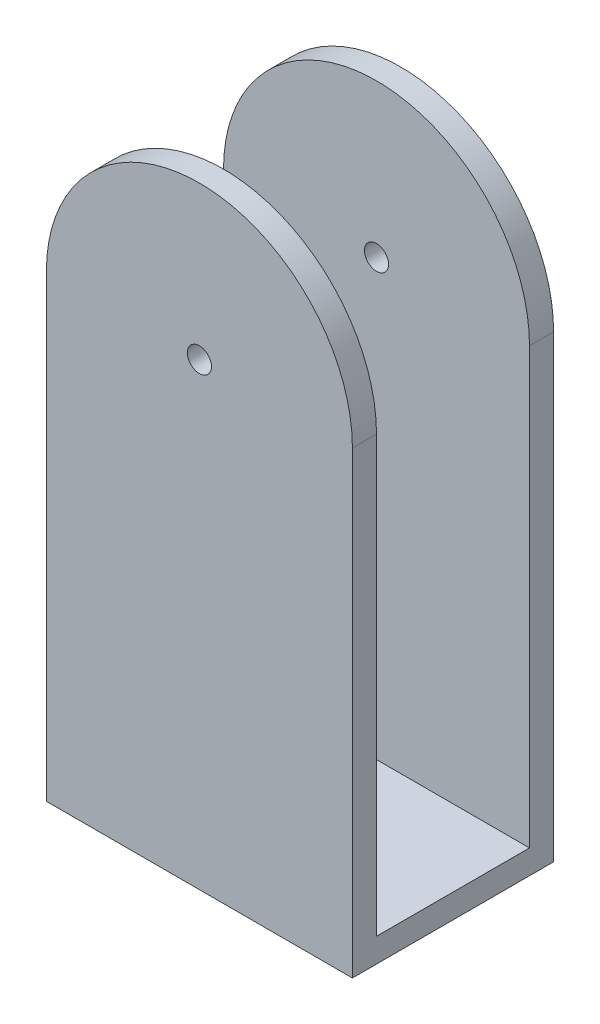
ISO-10303-21;
HEADER;
FILE_DESCRIPTION(('STEP AP214'),'2;1');
FILE_NAME('part.step','',(''),(''),'','','');
FILE_SCHEMA(('AUTOMOTIVE_DESIGN { 1 0 10303 214 1 1 1 1 }'));
ENDSEC;
DATA;
#1=APPLICATION_CONTEXT('core data for automotive mechanical design processes');
#2=APPLICATION_PROTOCOL_DEFINITION('international standard','automotive_design',2000,#1);
#3=PRODUCT_CONTEXT('',#1,'mechanical');
#4=PRODUCT('Part','Part','',(#3));
#5=PRODUCT_RELATED_PRODUCT_CATEGORY('part','',(#4));
#6=PRODUCT_DEFINITION_FORMATION('','',#4);
#7=PRODUCT_DEFINITION_CONTEXT('part definition',#1,'design');
#8=PRODUCT_DEFINITION('design','',#6,#7);
#9=PRODUCT_DEFINITION_SHAPE('','',#8);
#10=(LENGTH_UNIT() NAMED_UNIT(*) SI_UNIT(.MILLI.,.METRE.));
#11=(NAMED_UNIT(*) PLANE_ANGLE_UNIT() SI_UNIT($,.RADIAN.));
#12=(NAMED_UNIT(*) SI_UNIT($,.STERADIAN.) SOLID_ANGLE_UNIT());
#13=UNCERTAINTY_MEASURE_WITH_UNIT(LENGTH_MEASURE(1.E-05),#10,'distance_accuracy_value','');
#14=(GEOMETRIC_REPRESENTATION_CONTEXT(3) GLOBAL_UNCERTAINTY_ASSIGNED_CONTEXT((#13)) GLOBAL_UNIT_ASSIGNED_CONTEXT((#10,
#11,#12)) REPRESENTATION_CONTEXT('',''));
#15=CARTESIAN_POINT('',(0.,0.,0.));
#16=DIRECTION('',(0.,0.,1.));
#17=DIRECTION('',(1.,0.,0.));
#18=AXIS2_PLACEMENT_3D('',#15,#16,#17);
#19=CARTESIAN_POINT('',(6.35,19.05,1.));
#20=DIRECTION('',(0.,0.,-1.));
#21=DIRECTION('',(-1.,0.,0.));
#22=AXIS2_PLACEMENT_3D('',#19,#20,#21);
#23=PLANE('',#22);
#24=CARTESIAN_POINT('',(6.35,19.05,1.));
#25=DIRECTION('',(0.,0.,1.));
#26=DIRECTION('',(1.,0.,0.));
#27=AXIS2_PLACEMENT_3D('',#24,#25,#26);
#28=CIRCLE('',#27,0.5);
#29=CARTESIAN_POINT('',(6.85,19.05,1.));
#30=VERTEX_POINT('',#29);
#31=EDGE_CURVE('E100',#30,#30,#28,.T.);
#32=ORIENTED_EDGE('',*,*,#31,.F.);
#33=EDGE_LOOP('',(#32));
#34=FACE_BOUND('',#33,.T.);
#35=DIRECTION('',(-1.,0.,0.));
#36=VECTOR('',#35,1.);
#37=CARTESIAN_POINT('',(0.,1.,1.));
#38=LINE('',#37,#36);
#39=CARTESIAN_POINT('',(12.7,1.00000000000001,1.));
#40=VERTEX_POINT('',#39);
#41=CARTESIAN_POINT('',(0.,1.,1.));
#42=VERTEX_POINT('',#41);
#43=EDGE_CURVE('E47',#40,#42,#38,.T.);
#44=ORIENTED_EDGE('',*,*,#43,.F.);
#45=DIRECTION('',(0.,1.,0.));
#46=VECTOR('',#45,1.);
#47=CARTESIAN_POINT('',(12.7,19.05,1.));
#48=LINE('',#47,#46);
#49=CARTESIAN_POINT('',(12.7,19.05,1.));
#50=VERTEX_POINT('',#49);
#51=EDGE_CURVE('E85',#40,#50,#48,.T.);
#52=ORIENTED_EDGE('',*,*,#51,.T.);
#53=CARTESIAN_POINT('',(6.35,19.05,1.));
#54=DIRECTION('',(0.,0.,1.));
#55=DIRECTION('',(-1.,0.,0.));
#56=AXIS2_PLACEMENT_3D('',#53,#54,#55);
#57=CIRCLE('',#56,6.35);
#58=CARTESIAN_POINT('',(0.,19.05,1.));
#59=VERTEX_POINT('',#58);
#60=EDGE_CURVE('E53',#50,#59,#57,.T.);
#61=ORIENTED_EDGE('',*,*,#60,.T.);
#62=DIRECTION('',(0.,-1.,0.));
#63=VECTOR('',#62,1.);
#64=CARTESIAN_POINT('',(0.,0.,1.));
#65=LINE('',#64,#63);
#66=EDGE_CURVE('E95',#59,#42,#65,.T.);
#67=ORIENTED_EDGE('',*,*,#66,.T.);
#68=EDGE_LOOP('',(#44,#52,#61,#67));
#69=FACE_BOUND('',#68,.T.);
#70=ADVANCED_FACE('F32',(#34,#69),#23,.F.);
#71=CARTESIAN_POINT('',(6.35,19.05,0.));
#72=DIRECTION('',(0.,0.,-1.));
#73=DIRECTION('',(-1.,0.,0.));
#74=AXIS2_PLACEMENT_3D('',#71,#72,#73);
#75=PLANE('',#74);
#76=DIRECTION('',(1.,0.,0.));
#77=VECTOR('',#76,1.);
#78=CARTESIAN_POINT('',(12.7,0.,0.));
#79=LINE('',#78,#77);
#80=CARTESIAN_POINT('',(0.,0.,0.));
#81=VERTEX_POINT('',#80);
#82=CARTESIAN_POINT('',(12.7,0.,0.));
#83=VERTEX_POINT('',#82);
#84=EDGE_CURVE('E92',#81,#83,#79,.T.);
#85=ORIENTED_EDGE('',*,*,#84,.F.);
#86=DIRECTION('',(0.,-1.,0.));
#87=VECTOR('',#86,1.);
#88=CARTESIAN_POINT('',(0.,0.,0.));
#89=LINE('',#88,#87);
#90=CARTESIAN_POINT('',(0.,19.05,0.));
#91=VERTEX_POINT('',#90);
#92=EDGE_CURVE('E73',#91,#81,#89,.T.);
#93=ORIENTED_EDGE('',*,*,#92,.F.);
#94=CARTESIAN_POINT('',(6.35,19.05,0.));
#95=DIRECTION('',(0.,0.,1.));
#96=DIRECTION('',(-1.,0.,0.));
#97=AXIS2_PLACEMENT_3D('',#94,#95,#96);
#98=CIRCLE('',#97,6.35);
#99=CARTESIAN_POINT('',(12.7,19.05,0.));
#100=VERTEX_POINT('',#99);
#101=EDGE_CURVE('E86',#100,#91,#98,.T.);
#102=ORIENTED_EDGE('',*,*,#101,.F.);
#103=DIRECTION('',(0.,1.,0.));
#104=VECTOR('',#103,1.);
#105=CARTESIAN_POINT('',(12.7,19.05,0.));
#106=LINE('',#105,#104);
#107=EDGE_CURVE('E99',#83,#100,#106,.T.);
#108=ORIENTED_EDGE('',*,*,#107,.F.);
#109=EDGE_LOOP('',(#85,#93,#102,#108));
#110=FACE_BOUND('',#109,.T.);
#111=CARTESIAN_POINT('',(6.35,19.05,0.));
#112=DIRECTION('',(0.,0.,1.));
#113=DIRECTION('',(1.,0.,0.));
#114=AXIS2_PLACEMENT_3D('',#111,#112,#113);
#115=CIRCLE('',#114,0.5);
#116=CARTESIAN_POINT('',(6.85,19.05,0.));
#117=VERTEX_POINT('',#116);
#118=EDGE_CURVE('E104',#117,#117,#115,.T.);
#119=ORIENTED_EDGE('',*,*,#118,.T.);
#120=EDGE_LOOP('',(#119));
#121=FACE_BOUND('',#120,.T.);
#122=ADVANCED_FACE('F97',(#110,#121),#75,.T.);
#123=CARTESIAN_POINT('',(12.7,0.,1.));
#124=DIRECTION('',(0.,1.,0.));
#125=DIRECTION('',(0.,0.,1.));
#126=AXIS2_PLACEMENT_3D('',#123,#124,#125);
#127=PLANE('',#126);
#128=ORIENTED_EDGE('',*,*,#84,.T.);
#129=DIRECTION('',(0.,0.,-1.));
#130=VECTOR('',#129,1.);
#131=CARTESIAN_POINT('',(12.7,0.,1.));
#132=LINE('',#131,#130);
#133=CARTESIAN_POINT('',(12.7,0.,8.35));
#134=VERTEX_POINT('',#133);
#135=EDGE_CURVE('E11',#134,#83,#132,.T.);
#136=ORIENTED_EDGE('',*,*,#135,.F.);
#137=DIRECTION('',(1.,0.,0.));
#138=VECTOR('',#137,1.);
#139=CARTESIAN_POINT('',(0.,0.,8.35));
#140=LINE('',#139,#138);
#141=CARTESIAN_POINT('',(0.,0.,8.35));
#142=VERTEX_POINT('',#141);
#143=EDGE_CURVE('E94',#142,#134,#140,.T.);
#144=ORIENTED_EDGE('',*,*,#143,.F.);
#145=DIRECTION('',(0.,0.,-1.));
#146=VECTOR('',#145,1.);
#147=CARTESIAN_POINT('',(0.,0.,1.));
#148=LINE('',#147,#146);
#149=EDGE_CURVE('E78',#142,#81,#148,.T.);
#150=ORIENTED_EDGE('',*,*,#149,.T.);
#151=EDGE_LOOP('',(#128,#136,#144,#150));
#152=FACE_BOUND('',#151,.T.);
#153=ADVANCED_FACE('F34',(#152),#127,.F.);
#154=CARTESIAN_POINT('',(12.7,19.05,1.));
#155=DIRECTION('',(-1.,0.,0.));
#156=DIRECTION('',(0.,-1.,0.));
#157=AXIS2_PLACEMENT_3D('',#154,#155,#156);
#158=PLANE('',#157);
#159=ORIENTED_EDGE('',*,*,#107,.T.);
#160=DIRECTION('',(0.,0.,-1.));
#161=VECTOR('',#160,1.);
#162=CARTESIAN_POINT('',(12.7,19.05,1.));
#163=LINE('',#162,#161);
#164=EDGE_CURVE('E40',#50,#100,#163,.T.);
#165=ORIENTED_EDGE('',*,*,#164,.F.);
#166=ORIENTED_EDGE('',*,*,#51,.F.);
#167=DIRECTION('',(0.,0.,-1.));
#168=VECTOR('',#167,1.);
#169=CARTESIAN_POINT('',(12.7,1.,7.35));
#170=LINE('',#169,#168);
#171=CARTESIAN_POINT('',(12.7,1.,7.35));
#172=VERTEX_POINT('',#171);
#173=EDGE_CURVE('E159',#172,#40,#170,.T.);
#174=ORIENTED_EDGE('',*,*,#173,.F.);
#175=DIRECTION('',(0.,1.,0.));
#176=VECTOR('',#175,1.);
#177=CARTESIAN_POINT('',(12.7,0.,7.35));
#178=LINE('',#177,#176);
#179=CARTESIAN_POINT('',(12.7,19.05,7.35));
#180=VERTEX_POINT('',#179);
#181=EDGE_CURVE('E140',#172,#180,#178,.T.);
#182=ORIENTED_EDGE('',*,*,#181,.T.);
#183=DIRECTION('',(0.,0.,-1.));
#184=VECTOR('',#183,1.);
#185=CARTESIAN_POINT('',(12.7,19.05,8.35));
#186=LINE('',#185,#184);
#187=CARTESIAN_POINT('',(12.7,19.05,8.35));
#188=VERTEX_POINT('',#187);
#189=EDGE_CURVE('E134',#188,#180,#186,.T.);
#190=ORIENTED_EDGE('',*,*,#189,.F.);
#191=DIRECTION('',(0.,1.,0.));
#192=VECTOR('',#191,1.);
#193=CARTESIAN_POINT('',(12.7,0.,8.35));
#194=LINE('',#193,#192);
#195=EDGE_CURVE('E122',#134,#188,#194,.T.);
#196=ORIENTED_EDGE('',*,*,#195,.F.);
#197=ORIENTED_EDGE('',*,*,#135,.T.);
#198=EDGE_LOOP('',(#159,#165,#166,#174,#182,#190,#196,#197));
#199=FACE_BOUND('',#198,.T.);
#200=ADVANCED_FACE('F115',(#199),#158,.F.);
#201=CARTESIAN_POINT('',(6.35,19.05,1.));
#202=DIRECTION('',(0.,0.,-1.));
#203=DIRECTION('',(-1.,0.,0.));
#204=AXIS2_PLACEMENT_3D('',#201,#202,#203);
#205=CYLINDRICAL_SURFACE('',#204,6.35);
#206=ORIENTED_EDGE('',*,*,#101,.T.);
#207=DIRECTION('',(0.,0.,-1.));
#208=VECTOR('',#207,1.);
#209=CARTESIAN_POINT('',(0.,19.05,1.));
#210=LINE('',#209,#208);
#211=EDGE_CURVE('E81',#59,#91,#210,.T.);
#212=ORIENTED_EDGE('',*,*,#211,.F.);
#213=ORIENTED_EDGE('',*,*,#60,.F.);
#214=ORIENTED_EDGE('',*,*,#164,.T.);
#215=EDGE_LOOP('',(#206,#212,#213,#214));
#216=FACE_BOUND('',#215,.T.);
#217=ADVANCED_FACE('F113',(#216),#205,.T.);
#218=CARTESIAN_POINT('',(0.,0.,1.));
#219=DIRECTION('',(1.,0.,0.));
#220=DIRECTION('',(0.,0.,-1.));
#221=AXIS2_PLACEMENT_3D('',#218,#219,#220);
#222=PLANE('',#221);
#223=ORIENTED_EDGE('',*,*,#92,.T.);
#224=ORIENTED_EDGE('',*,*,#149,.F.);
#225=DIRECTION('',(0.,-1.,0.));
#226=VECTOR('',#225,1.);
#227=CARTESIAN_POINT('',(0.,19.05,8.35));
#228=LINE('',#227,#226);
#229=CARTESIAN_POINT('',(0.,19.05,8.35));
#230=VERTEX_POINT('',#229);
#231=EDGE_CURVE('E130',#230,#142,#228,.T.);
#232=ORIENTED_EDGE('',*,*,#231,.F.);
#233=DIRECTION('',(0.,0.,-1.));
#234=VECTOR('',#233,1.);
#235=CARTESIAN_POINT('',(0.,19.05,8.35));
#236=LINE('',#235,#234);
#237=CARTESIAN_POINT('',(0.,19.05,7.35));
#238=VERTEX_POINT('',#237);
#239=EDGE_CURVE('E131',#230,#238,#236,.T.);
#240=ORIENTED_EDGE('',*,*,#239,.T.);
#241=DIRECTION('',(0.,-1.,0.));
#242=VECTOR('',#241,1.);
#243=CARTESIAN_POINT('',(0.,19.05,7.35));
#244=LINE('',#243,#242);
#245=CARTESIAN_POINT('',(0.,1.00000000000001,7.35));
#246=VERTEX_POINT('',#245);
#247=EDGE_CURVE('E147',#238,#246,#244,.T.);
#248=ORIENTED_EDGE('',*,*,#247,.T.);
#249=DIRECTION('',(0.,0.,-1.));
#250=VECTOR('',#249,1.);
#251=CARTESIAN_POINT('',(0.,1.,7.35));
#252=LINE('',#251,#250);
#253=EDGE_CURVE('E155',#246,#42,#252,.T.);
#254=ORIENTED_EDGE('',*,*,#253,.T.);
#255=ORIENTED_EDGE('',*,*,#66,.F.);
#256=ORIENTED_EDGE('',*,*,#211,.T.);
#257=EDGE_LOOP('',(#223,#224,#232,#240,#248,#254,#255,#256));
#258=FACE_BOUND('',#257,.T.);
#259=ADVANCED_FACE('F75',(#258),#222,.F.);
#260=CARTESIAN_POINT('',(6.35,19.05,1.));
#261=DIRECTION('',(0.,0.,-1.));
#262=DIRECTION('',(-1.,0.,0.));
#263=AXIS2_PLACEMENT_3D('',#260,#261,#262);
#264=CYLINDRICAL_SURFACE('',#263,0.5);
#265=ORIENTED_EDGE('',*,*,#31,.T.);
#266=EDGE_LOOP('',(#265));
#267=FACE_BOUND('',#266,.T.);
#268=ORIENTED_EDGE('',*,*,#118,.F.);
#269=EDGE_LOOP('',(#268));
#270=FACE_BOUND('',#269,.T.);
#271=ADVANCED_FACE('F214',(#267,#270),#264,.F.);
#272=CARTESIAN_POINT('',(0.,1.,7.35));
#273=DIRECTION('',(0.,-1.,0.));
#274=DIRECTION('',(0.,0.,-1.));
#275=AXIS2_PLACEMENT_3D('',#272,#273,#274);
#276=PLANE('',#275);
#277=ORIENTED_EDGE('',*,*,#43,.T.);
#278=ORIENTED_EDGE('',*,*,#253,.F.);
#279=DIRECTION('',(-1.,0.,0.));
#280=VECTOR('',#279,1.);
#281=CARTESIAN_POINT('',(0.,1.,7.35));
#282=LINE('',#281,#280);
#283=EDGE_CURVE('E152',#172,#246,#282,.T.);
#284=ORIENTED_EDGE('',*,*,#283,.F.);
#285=ORIENTED_EDGE('',*,*,#173,.T.);
#286=EDGE_LOOP('',(#277,#278,#284,#285));
#287=FACE_BOUND('',#286,.T.);
#288=ADVANCED_FACE('F166',(#287),#276,.F.);
#289=CARTESIAN_POINT('',(6.35,19.05,7.35));
#290=DIRECTION('',(0.,0.,1.));
#291=DIRECTION('',(1.,0.,0.));
#292=AXIS2_PLACEMENT_3D('',#289,#290,#291);
#293=PLANE('',#292);
#294=CARTESIAN_POINT('',(6.35,19.05,7.35));
#295=DIRECTION('',(0.,0.,1.));
#296=DIRECTION('',(1.,0.,0.));
#297=AXIS2_PLACEMENT_3D('',#294,#295,#296);
#298=CIRCLE('',#297,0.5);
#299=CARTESIAN_POINT('',(6.85,19.05,7.35));
#300=VERTEX_POINT('',#299);
#301=EDGE_CURVE('E187',#300,#300,#298,.T.);
#302=ORIENTED_EDGE('',*,*,#301,.T.);
#303=EDGE_LOOP('',(#302));
#304=FACE_BOUND('',#303,.T.);
#305=ORIENTED_EDGE('',*,*,#181,.F.);
#306=ORIENTED_EDGE('',*,*,#283,.T.);
#307=ORIENTED_EDGE('',*,*,#247,.F.);
#308=CARTESIAN_POINT('',(6.35,19.05,7.35));
#309=DIRECTION('',(0.,0.,1.));
#310=DIRECTION('',(1.,0.,0.));
#311=AXIS2_PLACEMENT_3D('',#308,#309,#310);
#312=CIRCLE('',#311,6.35);
#313=EDGE_CURVE('E143',#180,#238,#312,.T.);
#314=ORIENTED_EDGE('',*,*,#313,.F.);
#315=EDGE_LOOP('',(#305,#306,#307,#314));
#316=FACE_BOUND('',#315,.T.);
#317=ADVANCED_FACE('F175',(#304,#316),#293,.F.);
#318=CARTESIAN_POINT('',(6.35,19.05,8.35));
#319=DIRECTION('',(0.,0.,1.));
#320=DIRECTION('',(1.,0.,0.));
#321=AXIS2_PLACEMENT_3D('',#318,#319,#320);
#322=PLANE('',#321);
#323=ORIENTED_EDGE('',*,*,#195,.T.);
#324=CARTESIAN_POINT('',(6.35,19.05,8.35));
#325=DIRECTION('',(0.,0.,1.));
#326=DIRECTION('',(1.,0.,0.));
#327=AXIS2_PLACEMENT_3D('',#324,#325,#326);
#328=CIRCLE('',#327,6.35);
#329=EDGE_CURVE('E136',#188,#230,#328,.T.);
#330=ORIENTED_EDGE('',*,*,#329,.T.);
#331=ORIENTED_EDGE('',*,*,#231,.T.);
#332=ORIENTED_EDGE('',*,*,#143,.T.);
#333=EDGE_LOOP('',(#323,#330,#331,#332));
#334=FACE_BOUND('',#333,.T.);
#335=CARTESIAN_POINT('',(6.35,19.05,8.35));
#336=DIRECTION('',(0.,0.,1.));
#337=DIRECTION('',(1.,0.,0.));
#338=AXIS2_PLACEMENT_3D('',#335,#336,#337);
#339=CIRCLE('',#338,0.5);
#340=CARTESIAN_POINT('',(6.85,19.05,8.35));
#341=VERTEX_POINT('',#340);
#342=EDGE_CURVE('E144',#341,#341,#339,.T.);
#343=ORIENTED_EDGE('',*,*,#342,.F.);
#344=EDGE_LOOP('',(#343));
#345=FACE_BOUND('',#344,.T.);
#346=ADVANCED_FACE('F126',(#334,#345),#322,.T.);
#347=CARTESIAN_POINT('',(6.35,19.05,8.35));
#348=DIRECTION('',(0.,0.,-1.));
#349=DIRECTION('',(-1.,0.,0.));
#350=AXIS2_PLACEMENT_3D('',#347,#348,#349);
#351=CYLINDRICAL_SURFACE('',#350,6.35);
#352=ORIENTED_EDGE('',*,*,#313,.T.);
#353=ORIENTED_EDGE('',*,*,#239,.F.);
#354=ORIENTED_EDGE('',*,*,#329,.F.);
#355=ORIENTED_EDGE('',*,*,#189,.T.);
#356=EDGE_LOOP('',(#352,#353,#354,#355));
#357=FACE_BOUND('',#356,.T.);
#358=ADVANCED_FACE('F184',(#357),#351,.T.);
#359=CARTESIAN_POINT('',(6.35,19.05,8.35));
#360=DIRECTION('',(0.,0.,-1.));
#361=DIRECTION('',(-1.,0.,0.));
#362=AXIS2_PLACEMENT_3D('',#359,#360,#361);
#363=CYLINDRICAL_SURFACE('',#362,0.5);
#364=ORIENTED_EDGE('',*,*,#342,.T.);
#365=EDGE_LOOP('',(#364));
#366=FACE_BOUND('',#365,.T.);
#367=ORIENTED_EDGE('',*,*,#301,.F.);
#368=EDGE_LOOP('',(#367));
#369=FACE_BOUND('',#368,.T.);
#370=ADVANCED_FACE('F193',(#366,#369),#363,.F.);
#371=CLOSED_SHELL('',(#70,#122,#153,#200,#217,#259,#271,#288,#317,#346,#358,#370));
#372=MANIFOLD_SOLID_BREP('B2',#371);
#373=ADVANCED_BREP_SHAPE_REPRESENTATION('',(#18,#372),#14);
#374=SHAPE_DEFINITION_REPRESENTATION(#9,#373);
ENDSEC;
END-ISO-10303-21;
